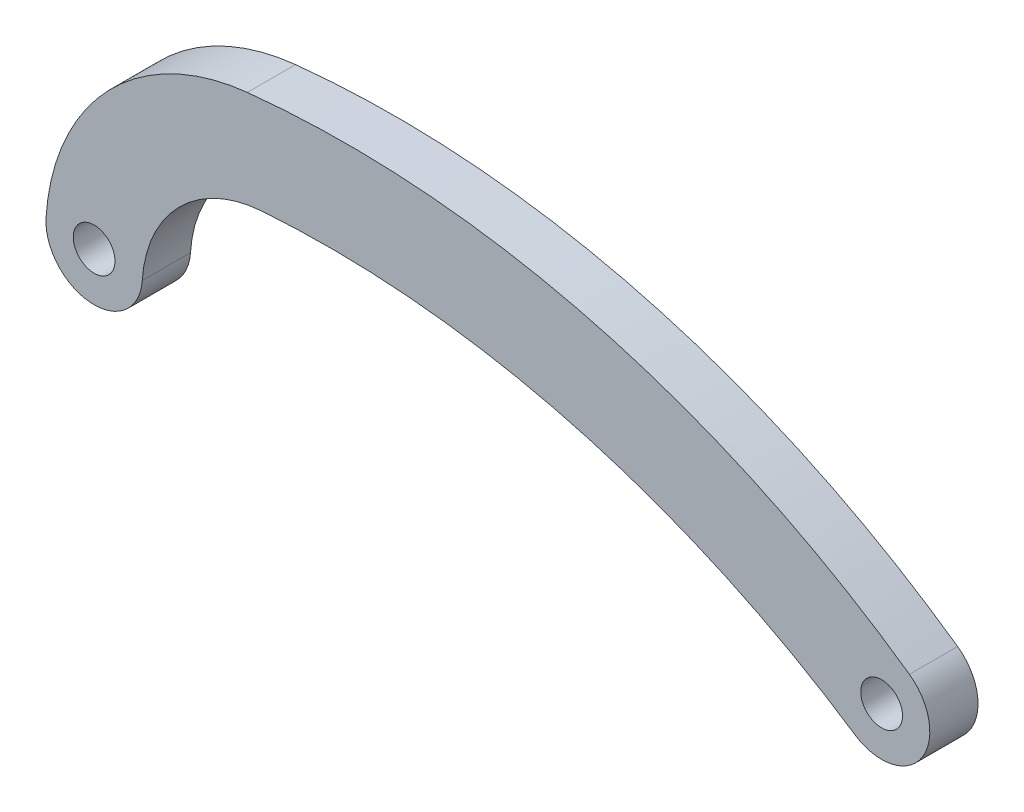
ISO-10303-21;
HEADER;
FILE_DESCRIPTION(('STEP AP214'),'2;1');
FILE_NAME('part.step','',(''),(''),'','','');
FILE_SCHEMA(('AUTOMOTIVE_DESIGN { 1 0 10303 214 1 1 1 1 }'));
ENDSEC;
DATA;
#1=APPLICATION_CONTEXT('core data for automotive mechanical design processes');
#2=APPLICATION_PROTOCOL_DEFINITION('international standard','automotive_design',2000,#1);
#3=PRODUCT_CONTEXT('',#1,'mechanical');
#4=PRODUCT('Part','Part','',(#3));
#5=PRODUCT_RELATED_PRODUCT_CATEGORY('part','',(#4));
#6=PRODUCT_DEFINITION_FORMATION('','',#4);
#7=PRODUCT_DEFINITION_CONTEXT('part definition',#1,'design');
#8=PRODUCT_DEFINITION('design','',#6,#7);
#9=PRODUCT_DEFINITION_SHAPE('','',#8);
#10=(LENGTH_UNIT() NAMED_UNIT(*) SI_UNIT(.MILLI.,.METRE.));
#11=(NAMED_UNIT(*) PLANE_ANGLE_UNIT() SI_UNIT($,.RADIAN.));
#12=(NAMED_UNIT(*) SI_UNIT($,.STERADIAN.) SOLID_ANGLE_UNIT());
#13=UNCERTAINTY_MEASURE_WITH_UNIT(LENGTH_MEASURE(1.E-05),#10,'distance_accuracy_value','');
#14=(GEOMETRIC_REPRESENTATION_CONTEXT(3) GLOBAL_UNCERTAINTY_ASSIGNED_CONTEXT((#13)) GLOBAL_UNIT_ASSIGNED_CONTEXT((#10,
#11,#12)) REPRESENTATION_CONTEXT('',''));
#15=CARTESIAN_POINT('',(0.,0.,0.));
#16=DIRECTION('',(0.,0.,1.));
#17=DIRECTION('',(1.,0.,0.));
#18=AXIS2_PLACEMENT_3D('',#15,#16,#17);
#19=CARTESIAN_POINT('',(45.3756484930419,-1.08506429604754,3.));
#20=DIRECTION('',(0.,0.,-1.));
#21=DIRECTION('',(-1.,0.,0.));
#22=AXIS2_PLACEMENT_3D('',#19,#20,#21);
#23=CYLINDRICAL_SURFACE('',#22,3.);
#24=CARTESIAN_POINT('',(45.3756484930419,-1.08506429604754,0.));
#25=DIRECTION('',(0.,0.,1.));
#26=DIRECTION('',(1.,0.,0.));
#27=AXIS2_PLACEMENT_3D('',#24,#25,#26);
#28=CIRCLE('',#27,3.);
#29=CARTESIAN_POINT('',(43.7094092421084,-3.57978808008633,0.));
#30=VERTEX_POINT('',#29);
#31=CARTESIAN_POINT('',(47.1047022989322,1.36654189915108,0.));
#32=VERTEX_POINT('',#31);
#33=EDGE_CURVE('E118',#30,#32,#28,.T.);
#34=ORIENTED_EDGE('',*,*,#33,.T.);
#35=DIRECTION('',(0.,0.,-1.));
#36=VECTOR('',#35,1.);
#37=CARTESIAN_POINT('',(47.1047022989322,1.36654189915108,3.));
#38=LINE('',#37,#36);
#39=CARTESIAN_POINT('',(47.1047022989322,1.36654189915108,3.));
#40=VERTEX_POINT('',#39);
#41=EDGE_CURVE('E11',#40,#32,#38,.T.);
#42=ORIENTED_EDGE('',*,*,#41,.F.);
#43=CARTESIAN_POINT('',(45.3756484930419,-1.08506429604754,3.));
#44=DIRECTION('',(0.,0.,1.));
#45=DIRECTION('',(1.,0.,0.));
#46=AXIS2_PLACEMENT_3D('',#43,#44,#45);
#47=CIRCLE('',#46,3.);
#48=CARTESIAN_POINT('',(43.7094092421084,-3.57978808008633,3.));
#49=VERTEX_POINT('',#48);
#50=EDGE_CURVE('E131',#49,#40,#47,.T.);
#51=ORIENTED_EDGE('',*,*,#50,.F.);
#52=DIRECTION('',(0.,0.,-1.));
#53=VECTOR('',#52,1.);
#54=CARTESIAN_POINT('',(43.7094092421084,-3.57978808008633,3.));
#55=LINE('',#54,#53);
#56=EDGE_CURVE('E49',#49,#30,#55,.T.);
#57=ORIENTED_EDGE('',*,*,#56,.T.);
#58=EDGE_LOOP('',(#34,#42,#51,#57));
#59=FACE_BOUND('',#58,.T.);
#60=ADVANCED_FACE('F33',(#59),#23,.T.);
#61=CARTESIAN_POINT('',(12.1625928691314,-48.1774871296611,3.));
#62=DIRECTION('',(0.,0.,-1.));
#63=DIRECTION('',(-1.,0.,0.));
#64=AXIS2_PLACEMENT_3D('',#61,#62,#63);
#65=CYLINDRICAL_SURFACE('',#64,60.6264119325229);
#66=CARTESIAN_POINT('',(12.1625928691314,-48.1774871296611,0.));
#67=DIRECTION('',(0.,0.,1.));
#68=DIRECTION('',(1.,0.,0.));
#69=AXIS2_PLACEMENT_3D('',#66,#67,#68);
#70=CIRCLE('',#69,60.6264119325229);
#71=CARTESIAN_POINT('',(5.90809592373186,12.1254405917352,0.));
#72=VERTEX_POINT('',#71);
#73=EDGE_CURVE('E120',#32,#72,#70,.T.);
#74=ORIENTED_EDGE('',*,*,#73,.T.);
#75=DIRECTION('',(0.,0.,-1.));
#76=VECTOR('',#75,1.);
#77=CARTESIAN_POINT('',(5.90809592373186,12.1254405917352,3.));
#78=LINE('',#77,#76);
#79=CARTESIAN_POINT('',(5.90809592373186,12.1254405917352,3.));
#80=VERTEX_POINT('',#79);
#81=EDGE_CURVE('E41',#80,#72,#78,.T.);
#82=ORIENTED_EDGE('',*,*,#81,.F.);
#83=CARTESIAN_POINT('',(12.1625928691314,-48.1774871296611,3.));
#84=DIRECTION('',(0.,0.,1.));
#85=DIRECTION('',(1.,0.,0.));
#86=AXIS2_PLACEMENT_3D('',#83,#84,#85);
#87=CIRCLE('',#86,60.6264119325229);
#88=EDGE_CURVE('E81',#40,#80,#87,.T.);
#89=ORIENTED_EDGE('',*,*,#88,.F.);
#90=ORIENTED_EDGE('',*,*,#41,.T.);
#91=EDGE_LOOP('',(#74,#82,#89,#90));
#92=FACE_BOUND('',#91,.T.);
#93=ADVANCED_FACE('F152',(#92),#65,.T.);
#94=CARTESIAN_POINT('',(7.3523997253992,-1.79985963944436,3.));
#95=DIRECTION('',(0.,0.,-1.));
#96=DIRECTION('',(-1.,0.,0.));
#97=AXIS2_PLACEMENT_3D('',#94,#95,#96);
#98=CYLINDRICAL_SURFACE('',#97,14.);
#99=CARTESIAN_POINT('',(7.3523997253992,-1.79985963944436,0.));
#100=DIRECTION('',(0.,0.,1.));
#101=DIRECTION('',(1.,0.,0.));
#102=AXIS2_PLACEMENT_3D('',#99,#100,#101);
#103=CIRCLE('',#102,14.);
#104=CARTESIAN_POINT('',(-6.61801093396468,-0.890120111484783,0.));
#105=VERTEX_POINT('',#104);
#106=EDGE_CURVE('E123',#72,#105,#103,.T.);
#107=ORIENTED_EDGE('',*,*,#106,.T.);
#108=DIRECTION('',(0.,0.,-1.));
#109=VECTOR('',#108,1.);
#110=CARTESIAN_POINT('',(-6.61801093396468,-0.890120111484783,3.));
#111=LINE('',#110,#109);
#112=CARTESIAN_POINT('',(-6.61801093396468,-0.890120111484783,3.));
#113=VERTEX_POINT('',#112);
#114=EDGE_CURVE('E110',#113,#105,#111,.T.);
#115=ORIENTED_EDGE('',*,*,#114,.F.);
#116=CARTESIAN_POINT('',(7.3523997253992,-1.79985963944436,3.));
#117=DIRECTION('',(0.,0.,1.));
#118=DIRECTION('',(1.,0.,0.));
#119=AXIS2_PLACEMENT_3D('',#116,#117,#118);
#120=CIRCLE('',#119,14.);
#121=EDGE_CURVE('E98',#80,#113,#120,.T.);
#122=ORIENTED_EDGE('',*,*,#121,.F.);
#123=ORIENTED_EDGE('',*,*,#81,.T.);
#124=EDGE_LOOP('',(#107,#115,#122,#123));
#125=FACE_BOUND('',#124,.T.);
#126=ADVANCED_FACE('F137',(#125),#98,.T.);
#127=CARTESIAN_POINT('',(-3.62435150695814,-1.08506429604755,3.));
#128=DIRECTION('',(0.,0.,-1.));
#129=DIRECTION('',(-1.,0.,0.));
#130=AXIS2_PLACEMENT_3D('',#127,#128,#129);
#131=CYLINDRICAL_SURFACE('',#130,3.);
#132=CARTESIAN_POINT('',(-3.62435150695814,-1.08506429604755,0.));
#133=DIRECTION('',(0.,0.,1.));
#134=DIRECTION('',(1.,0.,0.));
#135=AXIS2_PLACEMENT_3D('',#132,#133,#134);
#136=CIRCLE('',#135,3.);
#137=CARTESIAN_POINT('',(-0.630692079951591,-1.28000848061032,0.));
#138=VERTEX_POINT('',#137);
#139=EDGE_CURVE('E107',#105,#138,#136,.T.);
#140=ORIENTED_EDGE('',*,*,#139,.T.);
#141=DIRECTION('',(0.,0.,-1.));
#142=VECTOR('',#141,1.);
#143=CARTESIAN_POINT('',(-0.630692079951591,-1.28000848061032,3.));
#144=LINE('',#143,#142);
#145=CARTESIAN_POINT('',(-0.630692079951591,-1.28000848061032,3.));
#146=VERTEX_POINT('',#145);
#147=EDGE_CURVE('E104',#146,#138,#144,.T.);
#148=ORIENTED_EDGE('',*,*,#147,.F.);
#149=CARTESIAN_POINT('',(-3.62435150695814,-1.08506429604755,3.));
#150=DIRECTION('',(0.,0.,1.));
#151=DIRECTION('',(1.,0.,0.));
#152=AXIS2_PLACEMENT_3D('',#149,#150,#151);
#153=CIRCLE('',#152,3.);
#154=EDGE_CURVE('E91',#113,#146,#153,.T.);
#155=ORIENTED_EDGE('',*,*,#154,.F.);
#156=ORIENTED_EDGE('',*,*,#114,.T.);
#157=EDGE_LOOP('',(#140,#148,#155,#156));
#158=FACE_BOUND('',#157,.T.);
#159=ADVANCED_FACE('F105',(#158),#131,.T.);
#160=CARTESIAN_POINT('',(7.3523997253992,-1.79985963944436,3.));
#161=DIRECTION('',(0.,0.,-1.));
#162=DIRECTION('',(-1.,0.,0.));
#163=AXIS2_PLACEMENT_3D('',#160,#161,#162);
#164=CYLINDRICAL_SURFACE('',#163,8.);
#165=CARTESIAN_POINT('',(7.3523997253992,-1.79985963944436,0.));
#166=DIRECTION('',(0.,0.,1.));
#167=DIRECTION('',(1.,0.,0.));
#168=AXIS2_PLACEMENT_3D('',#165,#166,#167);
#169=CIRCLE('',#168,8.);
#170=CARTESIAN_POINT('',(6.77522696739972,6.17929267188692,0.));
#171=VERTEX_POINT('',#170);
#172=EDGE_CURVE('E126',#171,#138,#169,.T.);
#173=ORIENTED_EDGE('',*,*,#172,.F.);
#174=DIRECTION('',(0.,0.,-1.));
#175=VECTOR('',#174,1.);
#176=CARTESIAN_POINT('',(6.77522696739972,6.17929267188692,3.));
#177=LINE('',#176,#175);
#178=CARTESIAN_POINT('',(6.77522696739972,6.17929267188692,3.));
#179=VERTEX_POINT('',#178);
#180=EDGE_CURVE('E69',#179,#171,#177,.T.);
#181=ORIENTED_EDGE('',*,*,#180,.F.);
#182=CARTESIAN_POINT('',(7.3523997253992,-1.79985963944436,3.));
#183=DIRECTION('',(0.,0.,1.));
#184=DIRECTION('',(1.,0.,0.));
#185=AXIS2_PLACEMENT_3D('',#182,#183,#184);
#186=CIRCLE('',#185,8.);
#187=EDGE_CURVE('E96',#179,#146,#186,.T.);
#188=ORIENTED_EDGE('',*,*,#187,.T.);
#189=ORIENTED_EDGE('',*,*,#147,.T.);
#190=EDGE_LOOP('',(#173,#181,#188,#189));
#191=FACE_BOUND('',#190,.T.);
#192=ADVANCED_FACE('F112',(#191),#164,.F.);
#193=CARTESIAN_POINT('',(11.0213179332997,-52.5209943307691,3.));
#194=DIRECTION('',(0.,0.,-1.));
#195=DIRECTION('',(-1.,0.,0.));
#196=AXIS2_PLACEMENT_3D('',#193,#194,#195);
#197=CYLINDRICAL_SURFACE('',#196,58.8536573433197);
#198=CARTESIAN_POINT('',(11.0213179332997,-52.5209943307691,0.));
#199=DIRECTION('',(0.,0.,1.));
#200=DIRECTION('',(1.,0.,0.));
#201=AXIS2_PLACEMENT_3D('',#198,#199,#200);
#202=CIRCLE('',#201,58.8536573433197);
#203=EDGE_CURVE('E128',#30,#171,#202,.T.);
#204=ORIENTED_EDGE('',*,*,#203,.F.);
#205=ORIENTED_EDGE('',*,*,#56,.F.);
#206=CARTESIAN_POINT('',(11.0213179332997,-52.5209943307691,3.));
#207=DIRECTION('',(0.,0.,1.));
#208=DIRECTION('',(1.,0.,0.));
#209=AXIS2_PLACEMENT_3D('',#206,#207,#208);
#210=CIRCLE('',#209,58.8536573433197);
#211=EDGE_CURVE('E113',#49,#179,#210,.T.);
#212=ORIENTED_EDGE('',*,*,#211,.T.);
#213=ORIENTED_EDGE('',*,*,#180,.T.);
#214=EDGE_LOOP('',(#204,#205,#212,#213));
#215=FACE_BOUND('',#214,.T.);
#216=ADVANCED_FACE('F140',(#215),#197,.F.);
#217=CARTESIAN_POINT('',(28.7691206810866,-24.6312757128543,3.));
#218=DIRECTION('',(0.,0.,1.));
#219=DIRECTION('',(1.,0.,0.));
#220=AXIS2_PLACEMENT_3D('',#217,#218,#219);
#221=PLANE('',#220);
#222=CARTESIAN_POINT('',(-3.62435150695814,-1.08506429604755,3.));
#223=DIRECTION('',(0.,0.,1.));
#224=DIRECTION('',(1.,0.,0.));
#225=AXIS2_PLACEMENT_3D('',#222,#223,#224);
#226=CIRCLE('',#225,1.3);
#227=CARTESIAN_POINT('',(-2.32435150695814,-1.08506429604755,3.));
#228=VERTEX_POINT('',#227);
#229=EDGE_CURVE('E166',#228,#228,#226,.T.);
#230=ORIENTED_EDGE('',*,*,#229,.F.);
#231=EDGE_LOOP('',(#230));
#232=FACE_BOUND('',#231,.T.);
#233=CARTESIAN_POINT('',(45.3756484930419,-1.08506429604754,3.));
#234=DIRECTION('',(0.,0.,1.));
#235=DIRECTION('',(1.,0.,0.));
#236=AXIS2_PLACEMENT_3D('',#233,#234,#235);
#237=CIRCLE('',#236,1.3);
#238=CARTESIAN_POINT('',(46.6756484930419,-1.08506429604754,3.));
#239=VERTEX_POINT('',#238);
#240=EDGE_CURVE('E160',#239,#239,#237,.T.);
#241=ORIENTED_EDGE('',*,*,#240,.F.);
#242=EDGE_LOOP('',(#241));
#243=FACE_BOUND('',#242,.T.);
#244=ORIENTED_EDGE('',*,*,#50,.T.);
#245=ORIENTED_EDGE('',*,*,#88,.T.);
#246=ORIENTED_EDGE('',*,*,#121,.T.);
#247=ORIENTED_EDGE('',*,*,#154,.T.);
#248=ORIENTED_EDGE('',*,*,#187,.F.);
#249=ORIENTED_EDGE('',*,*,#211,.F.);
#250=EDGE_LOOP('',(#244,#245,#246,#247,#248,#249));
#251=FACE_BOUND('',#250,.T.);
#252=ADVANCED_FACE('F93',(#232,#243,#251),#221,.T.);
#253=CARTESIAN_POINT('',(28.7691206810866,-24.6312757128543,0.));
#254=DIRECTION('',(0.,0.,1.));
#255=DIRECTION('',(1.,0.,0.));
#256=AXIS2_PLACEMENT_3D('',#253,#254,#255);
#257=PLANE('',#256);
#258=CARTESIAN_POINT('',(-3.62435150695814,-1.08506429604755,0.));
#259=DIRECTION('',(0.,0.,1.));
#260=DIRECTION('',(1.,0.,0.));
#261=AXIS2_PLACEMENT_3D('',#258,#259,#260);
#262=CIRCLE('',#261,1.3);
#263=CARTESIAN_POINT('',(-2.32435150695814,-1.08506429604755,0.));
#264=VERTEX_POINT('',#263);
#265=EDGE_CURVE('E121',#264,#264,#262,.T.);
#266=ORIENTED_EDGE('',*,*,#265,.T.);
#267=EDGE_LOOP('',(#266));
#268=FACE_BOUND('',#267,.T.);
#269=CARTESIAN_POINT('',(45.3756484930419,-1.08506429604754,0.));
#270=DIRECTION('',(0.,0.,1.));
#271=DIRECTION('',(1.,0.,0.));
#272=AXIS2_PLACEMENT_3D('',#269,#270,#271);
#273=CIRCLE('',#272,1.3);
#274=CARTESIAN_POINT('',(46.6756484930419,-1.08506429604754,0.));
#275=VERTEX_POINT('',#274);
#276=EDGE_CURVE('E163',#275,#275,#273,.T.);
#277=ORIENTED_EDGE('',*,*,#276,.T.);
#278=EDGE_LOOP('',(#277));
#279=FACE_BOUND('',#278,.T.);
#280=ORIENTED_EDGE('',*,*,#33,.F.);
#281=ORIENTED_EDGE('',*,*,#203,.T.);
#282=ORIENTED_EDGE('',*,*,#172,.T.);
#283=ORIENTED_EDGE('',*,*,#139,.F.);
#284=ORIENTED_EDGE('',*,*,#106,.F.);
#285=ORIENTED_EDGE('',*,*,#73,.F.);
#286=EDGE_LOOP('',(#280,#281,#282,#283,#284,#285));
#287=FACE_BOUND('',#286,.T.);
#288=ADVANCED_FACE('F139',(#268,#279,#287),#257,.F.);
#289=CARTESIAN_POINT('',(45.3756484930419,-1.08506429604754,0.));
#290=DIRECTION('',(0.,0.,1.));
#291=DIRECTION('',(1.,0.,0.));
#292=AXIS2_PLACEMENT_3D('',#289,#290,#291);
#293=CYLINDRICAL_SURFACE('',#292,1.3);
#294=ORIENTED_EDGE('',*,*,#276,.F.);
#295=EDGE_LOOP('',(#294));
#296=FACE_BOUND('',#295,.T.);
#297=ORIENTED_EDGE('',*,*,#240,.T.);
#298=EDGE_LOOP('',(#297));
#299=FACE_BOUND('',#298,.T.);
#300=ADVANCED_FACE('F177',(#296,#299),#293,.F.);
#301=CARTESIAN_POINT('',(-3.62435150695814,-1.08506429604755,0.));
#302=DIRECTION('',(0.,0.,1.));
#303=DIRECTION('',(1.,0.,0.));
#304=AXIS2_PLACEMENT_3D('',#301,#302,#303);
#305=CYLINDRICAL_SURFACE('',#304,1.3);
#306=ORIENTED_EDGE('',*,*,#265,.F.);
#307=EDGE_LOOP('',(#306));
#308=FACE_BOUND('',#307,.T.);
#309=ORIENTED_EDGE('',*,*,#229,.T.);
#310=EDGE_LOOP('',(#309));
#311=FACE_BOUND('',#310,.T.);
#312=ADVANCED_FACE('F174',(#308,#311),#305,.F.);
#313=CLOSED_SHELL('',(#60,#93,#126,#159,#192,#216,#252,#288,#300,#312));
#314=MANIFOLD_SOLID_BREP('B2',#313);
#315=ADVANCED_BREP_SHAPE_REPRESENTATION('',(#18,#314),#14);
#316=SHAPE_DEFINITION_REPRESENTATION(#9,#315);
ENDSEC;
END-ISO-10303-21;
